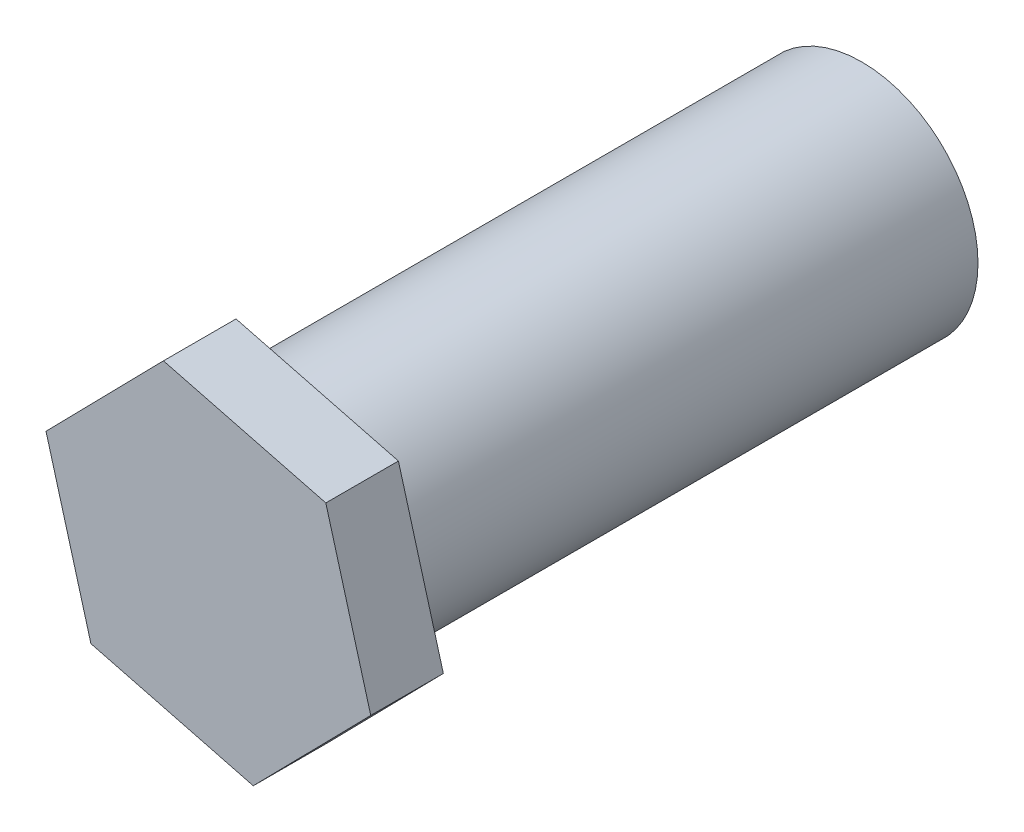
ISO-10303-21;
HEADER;
FILE_DESCRIPTION(('STEP AP214'),'2;1');
FILE_NAME('part.step','',(''),(''),'','','');
FILE_SCHEMA(('AUTOMOTIVE_DESIGN { 1 0 10303 214 1 1 1 1 }'));
ENDSEC;
DATA;
#1=APPLICATION_CONTEXT('core data for automotive mechanical design processes');
#2=APPLICATION_PROTOCOL_DEFINITION('international standard','automotive_design',2000,#1);
#3=PRODUCT_CONTEXT('',#1,'mechanical');
#4=PRODUCT('Part','Part','',(#3));
#5=PRODUCT_RELATED_PRODUCT_CATEGORY('part','',(#4));
#6=PRODUCT_DEFINITION_FORMATION('','',#4);
#7=PRODUCT_DEFINITION_CONTEXT('part definition',#1,'design');
#8=PRODUCT_DEFINITION('design','',#6,#7);
#9=PRODUCT_DEFINITION_SHAPE('','',#8);
#10=(LENGTH_UNIT() NAMED_UNIT(*) SI_UNIT(.MILLI.,.METRE.));
#11=(NAMED_UNIT(*) PLANE_ANGLE_UNIT() SI_UNIT($,.RADIAN.));
#12=(NAMED_UNIT(*) SI_UNIT($,.STERADIAN.) SOLID_ANGLE_UNIT());
#13=UNCERTAINTY_MEASURE_WITH_UNIT(LENGTH_MEASURE(1.E-05),#10,'distance_accuracy_value','');
#14=(GEOMETRIC_REPRESENTATION_CONTEXT(3) GLOBAL_UNCERTAINTY_ASSIGNED_CONTEXT((#13)) GLOBAL_UNIT_ASSIGNED_CONTEXT((#10,
#11,#12)) REPRESENTATION_CONTEXT('',''));
#15=CARTESIAN_POINT('',(0.,0.,0.));
#16=DIRECTION('',(0.,0.,1.));
#17=DIRECTION('',(1.,0.,0.));
#18=AXIS2_PLACEMENT_3D('',#15,#16,#17);
#19=CARTESIAN_POINT('',(0.,0.,200.));
#20=DIRECTION('',(0.,0.,-1.));
#21=DIRECTION('',(-1.,0.,0.));
#22=AXIS2_PLACEMENT_3D('',#19,#20,#21);
#23=CYLINDRICAL_SURFACE('',#22,40.);
#24=CARTESIAN_POINT('',(0.,0.,200.));
#25=DIRECTION('',(0.,0.,1.));
#26=DIRECTION('',(1.,0.,0.));
#27=AXIS2_PLACEMENT_3D('',#24,#25,#26);
#28=CIRCLE('',#27,40.);
#29=CARTESIAN_POINT('',(40.,0.,200.));
#30=VERTEX_POINT('',#29);
#31=EDGE_CURVE('E11',#30,#30,#28,.T.);
#32=ORIENTED_EDGE('',*,*,#31,.F.);
#33=EDGE_LOOP('',(#32));
#34=FACE_BOUND('',#33,.T.);
#35=CARTESIAN_POINT('',(0.,0.,0.));
#36=DIRECTION('',(0.,0.,1.));
#37=DIRECTION('',(1.,0.,0.));
#38=AXIS2_PLACEMENT_3D('',#35,#36,#37);
#39=CIRCLE('',#38,40.);
#40=CARTESIAN_POINT('',(40.,0.,0.));
#41=VERTEX_POINT('',#40);
#42=EDGE_CURVE('E36',#41,#41,#39,.T.);
#43=ORIENTED_EDGE('',*,*,#42,.T.);
#44=EDGE_LOOP('',(#43));
#45=FACE_BOUND('',#44,.T.);
#46=ADVANCED_FACE('F33',(#34,#45),#23,.T.);
#47=CARTESIAN_POINT('',(0.,0.,0.));
#48=DIRECTION('',(0.,0.,1.));
#49=DIRECTION('',(1.,0.,0.));
#50=AXIS2_PLACEMENT_3D('',#47,#48,#49);
#51=PLANE('',#50);
#52=ORIENTED_EDGE('',*,*,#42,.F.);
#53=EDGE_LOOP('',(#52));
#54=FACE_BOUND('',#53,.T.);
#55=ADVANCED_FACE('F141',(#54),#51,.F.);
#56=CARTESIAN_POINT('',(0.,0.,200.));
#57=DIRECTION('',(0.,0.,1.));
#58=DIRECTION('',(1.,0.,0.));
#59=AXIS2_PLACEMENT_3D('',#56,#57,#58);
#60=PLANE('',#59);
#61=DIRECTION('',(0.700407122258231,0.713743555550552,0.));
#62=VECTOR('',#61,1.);
#63=CARTESIAN_POINT('',(15.4681657486216,-55.6243578093851,200.));
#64=LINE('',#63,#62);
#65=CARTESIAN_POINT('',(15.4681657486216,-55.6243578093851,200.));
#66=VERTEX_POINT('',#65);
#67=CARTESIAN_POINT('',(55.9061898064336,-14.4163544164379,200.));
#68=VERTEX_POINT('',#67);
#69=EDGE_CURVE('E118',#66,#68,#64,.T.);
#70=ORIENTED_EDGE('',*,*,#69,.F.);
#71=DIRECTION('',(0.968323612023323,-0.249698583091905,0.));
#72=VECTOR('',#71,1.);
#73=CARTESIAN_POINT('',(-40.4380240578121,-41.2080033929472,200.));
#74=LINE('',#73,#72);
#75=CARTESIAN_POINT('',(-40.4380240578121,-41.2080033929472,200.));
#76=VERTEX_POINT('',#75);
#77=EDGE_CURVE('E78',#76,#66,#74,.T.);
#78=ORIENTED_EDGE('',*,*,#77,.F.);
#79=DIRECTION('',(0.267916489765092,-0.963442138642457,0.));
#80=VECTOR('',#79,1.);
#81=CARTESIAN_POINT('',(-55.9061898064337,14.4163544164379,200.));
#82=LINE('',#81,#80);
#83=CARTESIAN_POINT('',(-55.9061898064337,14.4163544164379,200.));
#84=VERTEX_POINT('',#83);
#85=EDGE_CURVE('E72',#84,#76,#82,.T.);
#86=ORIENTED_EDGE('',*,*,#85,.F.);
#87=DIRECTION('',(-0.700407122258231,-0.713743555550552,0.));
#88=VECTOR('',#87,1.);
#89=CARTESIAN_POINT('',(-15.4681657486216,55.6243578093852,200.));
#90=LINE('',#89,#88);
#91=CARTESIAN_POINT('',(-15.4681657486216,55.6243578093852,200.));
#92=VERTEX_POINT('',#91);
#93=EDGE_CURVE('E108',#92,#84,#90,.T.);
#94=ORIENTED_EDGE('',*,*,#93,.F.);
#95=DIRECTION('',(-0.968323612023323,0.249698583091905,0.));
#96=VECTOR('',#95,1.);
#97=CARTESIAN_POINT('',(40.4380240578121,41.2080033929472,200.));
#98=LINE('',#97,#96);
#99=CARTESIAN_POINT('',(40.4380240578121,41.2080033929472,200.));
#100=VERTEX_POINT('',#99);
#101=EDGE_CURVE('E123',#100,#92,#98,.T.);
#102=ORIENTED_EDGE('',*,*,#101,.F.);
#103=DIRECTION('',(-0.267916489765092,0.963442138642457,0.));
#104=VECTOR('',#103,1.);
#105=CARTESIAN_POINT('',(55.9061898064336,-14.4163544164379,200.));
#106=LINE('',#105,#104);
#107=EDGE_CURVE('E121',#68,#100,#106,.T.);
#108=ORIENTED_EDGE('',*,*,#107,.F.);
#109=EDGE_LOOP('',(#70,#78,#86,#94,#102,#108));
#110=FACE_BOUND('',#109,.T.);
#111=ORIENTED_EDGE('',*,*,#31,.T.);
#112=EDGE_LOOP('',(#111));
#113=FACE_BOUND('',#112,.T.);
#114=ADVANCED_FACE('F143',(#110,#113),#60,.F.);
#115=CARTESIAN_POINT('',(15.4681657486216,-55.6243578093851,225.));
#116=DIRECTION('',(-0.713743555550552,0.700407122258231,0.));
#117=DIRECTION('',(-0.700407122258231,-0.713743555550552,0.));
#118=AXIS2_PLACEMENT_3D('',#115,#116,#117);
#119=PLANE('',#118);
#120=ORIENTED_EDGE('',*,*,#69,.T.);
#121=DIRECTION('',(0.,0.,-1.));
#122=VECTOR('',#121,1.);
#123=CARTESIAN_POINT('',(55.9061898064336,-14.4163544164379,225.));
#124=LINE('',#123,#122);
#125=CARTESIAN_POINT('',(55.9061898064336,-14.4163544164379,225.));
#126=VERTEX_POINT('',#125);
#127=EDGE_CURVE('E135',#126,#68,#124,.T.);
#128=ORIENTED_EDGE('',*,*,#127,.F.);
#129=DIRECTION('',(0.700407122258231,0.713743555550552,0.));
#130=VECTOR('',#129,1.);
#131=CARTESIAN_POINT('',(15.4681657486216,-55.6243578093851,225.));
#132=LINE('',#131,#130);
#133=CARTESIAN_POINT('',(15.4681657486216,-55.6243578093851,225.));
#134=VERTEX_POINT('',#133);
#135=EDGE_CURVE('E128',#134,#126,#132,.T.);
#136=ORIENTED_EDGE('',*,*,#135,.F.);
#137=DIRECTION('',(0.,0.,-1.));
#138=VECTOR('',#137,1.);
#139=CARTESIAN_POINT('',(15.4681657486216,-55.6243578093851,225.));
#140=LINE('',#139,#138);
#141=EDGE_CURVE('E114',#134,#66,#140,.T.);
#142=ORIENTED_EDGE('',*,*,#141,.T.);
#143=EDGE_LOOP('',(#120,#128,#136,#142));
#144=FACE_BOUND('',#143,.T.);
#145=ADVANCED_FACE('F148',(#144),#119,.F.);
#146=CARTESIAN_POINT('',(55.9061898064336,-14.4163544164379,225.));
#147=DIRECTION('',(-0.963442138642457,-0.267916489765092,0.));
#148=DIRECTION('',(0.267916489765092,-0.963442138642457,0.));
#149=AXIS2_PLACEMENT_3D('',#146,#147,#148);
#150=PLANE('',#149);
#151=ORIENTED_EDGE('',*,*,#107,.T.);
#152=DIRECTION('',(0.,0.,-1.));
#153=VECTOR('',#152,1.);
#154=CARTESIAN_POINT('',(40.4380240578121,41.2080033929472,225.));
#155=LINE('',#154,#153);
#156=CARTESIAN_POINT('',(40.4380240578121,41.2080033929472,225.));
#157=VERTEX_POINT('',#156);
#158=EDGE_CURVE('E132',#157,#100,#155,.T.);
#159=ORIENTED_EDGE('',*,*,#158,.F.);
#160=DIRECTION('',(-0.267916489765092,0.963442138642457,0.));
#161=VECTOR('',#160,1.);
#162=CARTESIAN_POINT('',(55.9061898064336,-14.4163544164379,225.));
#163=LINE('',#162,#161);
#164=EDGE_CURVE('E87',#126,#157,#163,.T.);
#165=ORIENTED_EDGE('',*,*,#164,.F.);
#166=ORIENTED_EDGE('',*,*,#127,.T.);
#167=EDGE_LOOP('',(#151,#159,#165,#166));
#168=FACE_BOUND('',#167,.T.);
#169=ADVANCED_FACE('F155',(#168),#150,.F.);
#170=CARTESIAN_POINT('',(40.4380240578121,41.2080033929472,225.));
#171=DIRECTION('',(-0.249698583091905,-0.968323612023323,0.));
#172=DIRECTION('',(0.968323612023323,-0.249698583091905,0.));
#173=AXIS2_PLACEMENT_3D('',#170,#171,#172);
#174=PLANE('',#173);
#175=ORIENTED_EDGE('',*,*,#101,.T.);
#176=DIRECTION('',(0.,0.,-1.));
#177=VECTOR('',#176,1.);
#178=CARTESIAN_POINT('',(-15.4681657486216,55.6243578093852,225.));
#179=LINE('',#178,#177);
#180=CARTESIAN_POINT('',(-15.4681657486216,55.6243578093852,225.));
#181=VERTEX_POINT('',#180);
#182=EDGE_CURVE('E109',#181,#92,#179,.T.);
#183=ORIENTED_EDGE('',*,*,#182,.F.);
#184=DIRECTION('',(-0.968323612023323,0.249698583091905,0.));
#185=VECTOR('',#184,1.);
#186=CARTESIAN_POINT('',(40.4380240578121,41.2080033929472,225.));
#187=LINE('',#186,#185);
#188=EDGE_CURVE('E100',#157,#181,#187,.T.);
#189=ORIENTED_EDGE('',*,*,#188,.F.);
#190=ORIENTED_EDGE('',*,*,#158,.T.);
#191=EDGE_LOOP('',(#175,#183,#189,#190));
#192=FACE_BOUND('',#191,.T.);
#193=ADVANCED_FACE('F159',(#192),#174,.F.);
#194=CARTESIAN_POINT('',(-15.4681657486216,55.6243578093852,225.));
#195=DIRECTION('',(0.713743555550552,-0.700407122258231,0.));
#196=DIRECTION('',(0.700407122258231,0.713743555550552,0.));
#197=AXIS2_PLACEMENT_3D('',#194,#195,#196);
#198=PLANE('',#197);
#199=ORIENTED_EDGE('',*,*,#93,.T.);
#200=DIRECTION('',(0.,0.,-1.));
#201=VECTOR('',#200,1.);
#202=CARTESIAN_POINT('',(-55.9061898064337,14.4163544164379,225.));
#203=LINE('',#202,#201);
#204=CARTESIAN_POINT('',(-55.9061898064337,14.4163544164379,225.));
#205=VERTEX_POINT('',#204);
#206=EDGE_CURVE('E105',#205,#84,#203,.T.);
#207=ORIENTED_EDGE('',*,*,#206,.F.);
#208=DIRECTION('',(-0.700407122258231,-0.713743555550552,0.));
#209=VECTOR('',#208,1.);
#210=CARTESIAN_POINT('',(-15.4681657486216,55.6243578093852,225.));
#211=LINE('',#210,#209);
#212=EDGE_CURVE('E94',#181,#205,#211,.T.);
#213=ORIENTED_EDGE('',*,*,#212,.F.);
#214=ORIENTED_EDGE('',*,*,#182,.T.);
#215=EDGE_LOOP('',(#199,#207,#213,#214));
#216=FACE_BOUND('',#215,.T.);
#217=ADVANCED_FACE('F106',(#216),#198,.F.);
#218=CARTESIAN_POINT('',(-55.9061898064337,14.4163544164379,225.));
#219=DIRECTION('',(0.963442138642457,0.267916489765092,0.));
#220=DIRECTION('',(-0.267916489765092,0.963442138642457,0.));
#221=AXIS2_PLACEMENT_3D('',#218,#219,#220);
#222=PLANE('',#221);
#223=ORIENTED_EDGE('',*,*,#85,.T.);
#224=DIRECTION('',(0.,0.,-1.));
#225=VECTOR('',#224,1.);
#226=CARTESIAN_POINT('',(-40.4380240578121,-41.2080033929472,225.));
#227=LINE('',#226,#225);
#228=CARTESIAN_POINT('',(-40.4380240578121,-41.2080033929472,225.));
#229=VERTEX_POINT('',#228);
#230=EDGE_CURVE('E110',#229,#76,#227,.T.);
#231=ORIENTED_EDGE('',*,*,#230,.F.);
#232=DIRECTION('',(0.267916489765092,-0.963442138642457,0.));
#233=VECTOR('',#232,1.);
#234=CARTESIAN_POINT('',(-55.9061898064337,14.4163544164379,225.));
#235=LINE('',#234,#233);
#236=EDGE_CURVE('E98',#205,#229,#235,.T.);
#237=ORIENTED_EDGE('',*,*,#236,.F.);
#238=ORIENTED_EDGE('',*,*,#206,.T.);
#239=EDGE_LOOP('',(#223,#231,#237,#238));
#240=FACE_BOUND('',#239,.T.);
#241=ADVANCED_FACE('F112',(#240),#222,.F.);
#242=CARTESIAN_POINT('',(-40.4380240578121,-41.2080033929472,225.));
#243=DIRECTION('',(0.249698583091905,0.968323612023323,0.));
#244=DIRECTION('',(-0.968323612023323,0.249698583091905,0.));
#245=AXIS2_PLACEMENT_3D('',#242,#243,#244);
#246=PLANE('',#245);
#247=ORIENTED_EDGE('',*,*,#77,.T.);
#248=ORIENTED_EDGE('',*,*,#141,.F.);
#249=DIRECTION('',(0.968323612023323,-0.249698583091905,0.));
#250=VECTOR('',#249,1.);
#251=CARTESIAN_POINT('',(-40.4380240578121,-41.2080033929472,225.));
#252=LINE('',#251,#250);
#253=EDGE_CURVE('E49',#229,#134,#252,.T.);
#254=ORIENTED_EDGE('',*,*,#253,.F.);
#255=ORIENTED_EDGE('',*,*,#230,.T.);
#256=EDGE_LOOP('',(#247,#248,#254,#255));
#257=FACE_BOUND('',#256,.T.);
#258=ADVANCED_FACE('F167',(#257),#246,.F.);
#259=CARTESIAN_POINT('',(0.,0.,225.));
#260=DIRECTION('',(0.,0.,1.));
#261=DIRECTION('',(1.,0.,0.));
#262=AXIS2_PLACEMENT_3D('',#259,#260,#261);
#263=PLANE('',#262);
#264=ORIENTED_EDGE('',*,*,#135,.T.);
#265=ORIENTED_EDGE('',*,*,#164,.T.);
#266=ORIENTED_EDGE('',*,*,#188,.T.);
#267=ORIENTED_EDGE('',*,*,#212,.T.);
#268=ORIENTED_EDGE('',*,*,#236,.T.);
#269=ORIENTED_EDGE('',*,*,#253,.T.);
#270=EDGE_LOOP('',(#264,#265,#266,#267,#268,#269));
#271=FACE_BOUND('',#270,.T.);
#272=ADVANCED_FACE('F96',(#271),#263,.T.);
#273=CLOSED_SHELL('',(#46,#55,#114,#145,#169,#193,#217,#241,#258,#272));
#274=MANIFOLD_SOLID_BREP('B2',#273);
#275=ADVANCED_BREP_SHAPE_REPRESENTATION('',(#18,#274),#14);
#276=SHAPE_DEFINITION_REPRESENTATION(#9,#275);
ENDSEC;
END-ISO-10303-21;
